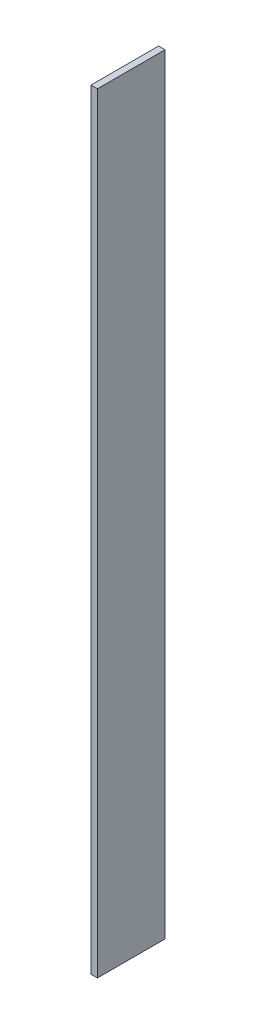
ISO-10303-21;
HEADER;
FILE_DESCRIPTION(('STEP AP214'),'2;1');
FILE_NAME('part.step','',(''),(''),'','','');
FILE_SCHEMA(('AUTOMOTIVE_DESIGN { 1 0 10303 214 1 1 1 1 }'));
ENDSEC;
DATA;
#1=APPLICATION_CONTEXT('core data for automotive mechanical design processes');
#2=APPLICATION_PROTOCOL_DEFINITION('international standard','automotive_design',2000,#1);
#3=PRODUCT_CONTEXT('',#1,'mechanical');
#4=PRODUCT('Part','Part','',(#3));
#5=PRODUCT_RELATED_PRODUCT_CATEGORY('part','',(#4));
#6=PRODUCT_DEFINITION_FORMATION('','',#4);
#7=PRODUCT_DEFINITION_CONTEXT('part definition',#1,'design');
#8=PRODUCT_DEFINITION('design','',#6,#7);
#9=PRODUCT_DEFINITION_SHAPE('','',#8);
#10=(LENGTH_UNIT() NAMED_UNIT(*) SI_UNIT(.MILLI.,.METRE.));
#11=(NAMED_UNIT(*) PLANE_ANGLE_UNIT() SI_UNIT($,.RADIAN.));
#12=(NAMED_UNIT(*) SI_UNIT($,.STERADIAN.) SOLID_ANGLE_UNIT());
#13=UNCERTAINTY_MEASURE_WITH_UNIT(LENGTH_MEASURE(1.E-05),#10,'distance_accuracy_value','');
#14=(GEOMETRIC_REPRESENTATION_CONTEXT(3) GLOBAL_UNCERTAINTY_ASSIGNED_CONTEXT((#13)) GLOBAL_UNIT_ASSIGNED_CONTEXT((#10,
#11,#12)) REPRESENTATION_CONTEXT('',''));
#15=CARTESIAN_POINT('',(0.,0.,0.));
#16=DIRECTION('',(0.,0.,1.));
#17=DIRECTION('',(1.,0.,0.));
#18=AXIS2_PLACEMENT_3D('',#15,#16,#17);
#19=CARTESIAN_POINT('',(1.21412,-72.2312499999998,-6.35));
#20=DIRECTION('',(0.,0.,1.));
#21=DIRECTION('',(1.,0.,0.));
#22=AXIS2_PLACEMENT_3D('',#19,#20,#21);
#23=PLANE('',#22);
#24=DIRECTION('',(0.,1.,0.));
#25=VECTOR('',#24,1.);
#26=CARTESIAN_POINT('',(0.,-72.2312499999998,-6.35));
#27=LINE('',#26,#25);
#28=CARTESIAN_POINT('',(0.,-72.2312499999998,-6.35));
#29=VERTEX_POINT('',#28);
#30=CARTESIAN_POINT('',(0.,72.2312500000002,-6.35));
#31=VERTEX_POINT('',#30);
#32=EDGE_CURVE('E111',#29,#31,#27,.T.);
#33=ORIENTED_EDGE('',*,*,#32,.T.);
#34=DIRECTION('',(-1.,0.,0.));
#35=VECTOR('',#34,1.);
#36=CARTESIAN_POINT('',(1.21412,72.2312500000002,-6.35));
#37=LINE('',#36,#35);
#38=CARTESIAN_POINT('',(1.21412,72.2312500000002,-6.35));
#39=VERTEX_POINT('',#38);
#40=EDGE_CURVE('E11',#39,#31,#37,.T.);
#41=ORIENTED_EDGE('',*,*,#40,.F.);
#42=DIRECTION('',(0.,1.,0.));
#43=VECTOR('',#42,1.);
#44=CARTESIAN_POINT('',(1.21412,-72.2312499999998,-6.35));
#45=LINE('',#44,#43);
#46=CARTESIAN_POINT('',(1.21412,-72.2312499999998,-6.35));
#47=VERTEX_POINT('',#46);
#48=EDGE_CURVE('E95',#47,#39,#45,.T.);
#49=ORIENTED_EDGE('',*,*,#48,.F.);
#50=DIRECTION('',(-1.,0.,0.));
#51=VECTOR('',#50,1.);
#52=CARTESIAN_POINT('',(1.21412,-72.2312499999998,-6.35));
#53=LINE('',#52,#51);
#54=EDGE_CURVE('E107',#47,#29,#53,.T.);
#55=ORIENTED_EDGE('',*,*,#54,.T.);
#56=EDGE_LOOP('',(#33,#41,#49,#55));
#57=FACE_BOUND('',#56,.T.);
#58=ADVANCED_FACE('F43',(#57),#23,.F.);
#59=CARTESIAN_POINT('',(1.21412,72.2312500000002,6.35));
#60=DIRECTION('',(0.,-1.,0.));
#61=DIRECTION('',(0.,0.,-1.));
#62=AXIS2_PLACEMENT_3D('',#59,#60,#61);
#63=PLANE('',#62);
#64=DIRECTION('',(0.,0.,1.));
#65=VECTOR('',#64,1.);
#66=CARTESIAN_POINT('',(0.,72.2312500000002,6.35));
#67=LINE('',#66,#65);
#68=CARTESIAN_POINT('',(0.,72.2312500000002,6.35));
#69=VERTEX_POINT('',#68);
#70=EDGE_CURVE('E100',#31,#69,#67,.T.);
#71=ORIENTED_EDGE('',*,*,#70,.T.);
#72=DIRECTION('',(-1.,0.,0.));
#73=VECTOR('',#72,1.);
#74=CARTESIAN_POINT('',(1.21412,72.2312500000002,6.35));
#75=LINE('',#74,#73);
#76=CARTESIAN_POINT('',(1.21412,72.2312500000002,6.35));
#77=VERTEX_POINT('',#76);
#78=EDGE_CURVE('E52',#77,#69,#75,.T.);
#79=ORIENTED_EDGE('',*,*,#78,.F.);
#80=DIRECTION('',(0.,0.,1.));
#81=VECTOR('',#80,1.);
#82=CARTESIAN_POINT('',(1.21412,72.2312500000002,6.35));
#83=LINE('',#82,#81);
#84=EDGE_CURVE('E90',#39,#77,#83,.T.);
#85=ORIENTED_EDGE('',*,*,#84,.F.);
#86=ORIENTED_EDGE('',*,*,#40,.T.);
#87=EDGE_LOOP('',(#71,#79,#85,#86));
#88=FACE_BOUND('',#87,.T.);
#89=ADVANCED_FACE('F99',(#88),#63,.F.);
#90=CARTESIAN_POINT('',(1.21412,-72.2312499999998,6.35));
#91=DIRECTION('',(0.,0.,-1.));
#92=DIRECTION('',(-1.,0.,0.));
#93=AXIS2_PLACEMENT_3D('',#90,#91,#92);
#94=PLANE('',#93);
#95=DIRECTION('',(0.,-1.,0.));
#96=VECTOR('',#95,1.);
#97=CARTESIAN_POINT('',(0.,-72.2312499999998,6.35));
#98=LINE('',#97,#96);
#99=CARTESIAN_POINT('',(0.,-72.2312499999998,6.35));
#100=VERTEX_POINT('',#99);
#101=EDGE_CURVE('E77',#69,#100,#98,.T.);
#102=ORIENTED_EDGE('',*,*,#101,.T.);
#103=DIRECTION('',(-1.,0.,0.));
#104=VECTOR('',#103,1.);
#105=CARTESIAN_POINT('',(1.21412,-72.2312499999998,6.35));
#106=LINE('',#105,#104);
#107=CARTESIAN_POINT('',(1.21412,-72.2312499999998,6.35));
#108=VERTEX_POINT('',#107);
#109=EDGE_CURVE('E102',#108,#100,#106,.T.);
#110=ORIENTED_EDGE('',*,*,#109,.F.);
#111=DIRECTION('',(0.,-1.,0.));
#112=VECTOR('',#111,1.);
#113=CARTESIAN_POINT('',(1.21412,-72.2312499999998,6.35));
#114=LINE('',#113,#112);
#115=EDGE_CURVE('E93',#77,#108,#114,.T.);
#116=ORIENTED_EDGE('',*,*,#115,.F.);
#117=ORIENTED_EDGE('',*,*,#78,.T.);
#118=EDGE_LOOP('',(#102,#110,#116,#117));
#119=FACE_BOUND('',#118,.T.);
#120=ADVANCED_FACE('F103',(#119),#94,.F.);
#121=CARTESIAN_POINT('',(1.21412,-72.2312499999998,6.35));
#122=DIRECTION('',(0.,1.,0.));
#123=DIRECTION('',(0.,0.,1.));
#124=AXIS2_PLACEMENT_3D('',#121,#122,#123);
#125=PLANE('',#124);
#126=DIRECTION('',(0.,0.,-1.));
#127=VECTOR('',#126,1.);
#128=CARTESIAN_POINT('',(0.,-72.2312499999998,6.35));
#129=LINE('',#128,#127);
#130=EDGE_CURVE('E83',#100,#29,#129,.T.);
#131=ORIENTED_EDGE('',*,*,#130,.T.);
#132=ORIENTED_EDGE('',*,*,#54,.F.);
#133=DIRECTION('',(0.,0.,-1.));
#134=VECTOR('',#133,1.);
#135=CARTESIAN_POINT('',(1.21412,-72.2312499999998,6.35));
#136=LINE('',#135,#134);
#137=EDGE_CURVE('E60',#108,#47,#136,.T.);
#138=ORIENTED_EDGE('',*,*,#137,.F.);
#139=ORIENTED_EDGE('',*,*,#109,.T.);
#140=EDGE_LOOP('',(#131,#132,#138,#139));
#141=FACE_BOUND('',#140,.T.);
#142=ADVANCED_FACE('F124',(#141),#125,.F.);
#143=CARTESIAN_POINT('',(1.21412,0.,0.));
#144=DIRECTION('',(-1.,0.,0.));
#145=DIRECTION('',(0.,0.,1.));
#146=AXIS2_PLACEMENT_3D('',#143,#144,#145);
#147=PLANE('',#146);
#148=ORIENTED_EDGE('',*,*,#48,.T.);
#149=ORIENTED_EDGE('',*,*,#84,.T.);
#150=ORIENTED_EDGE('',*,*,#115,.T.);
#151=ORIENTED_EDGE('',*,*,#137,.T.);
#152=EDGE_LOOP('',(#148,#149,#150,#151));
#153=FACE_BOUND('',#152,.T.);
#154=ADVANCED_FACE('F91',(#153),#147,.F.);
#155=CARTESIAN_POINT('',(0.,0.,0.));
#156=DIRECTION('',(-1.,0.,0.));
#157=DIRECTION('',(0.,0.,1.));
#158=AXIS2_PLACEMENT_3D('',#155,#156,#157);
#159=PLANE('',#158);
#160=ORIENTED_EDGE('',*,*,#32,.F.);
#161=ORIENTED_EDGE('',*,*,#130,.F.);
#162=ORIENTED_EDGE('',*,*,#101,.F.);
#163=ORIENTED_EDGE('',*,*,#70,.F.);
#164=EDGE_LOOP('',(#160,#161,#162,#163));
#165=FACE_BOUND('',#164,.T.);
#166=ADVANCED_FACE('F127',(#165),#159,.T.);
#167=CLOSED_SHELL('',(#58,#89,#120,#142,#154,#166));
#168=MANIFOLD_SOLID_BREP('B2',#167);
#169=ADVANCED_BREP_SHAPE_REPRESENTATION('',(#18,#168),#14);
#170=SHAPE_DEFINITION_REPRESENTATION(#9,#169);
ENDSEC;
END-ISO-10303-21;
